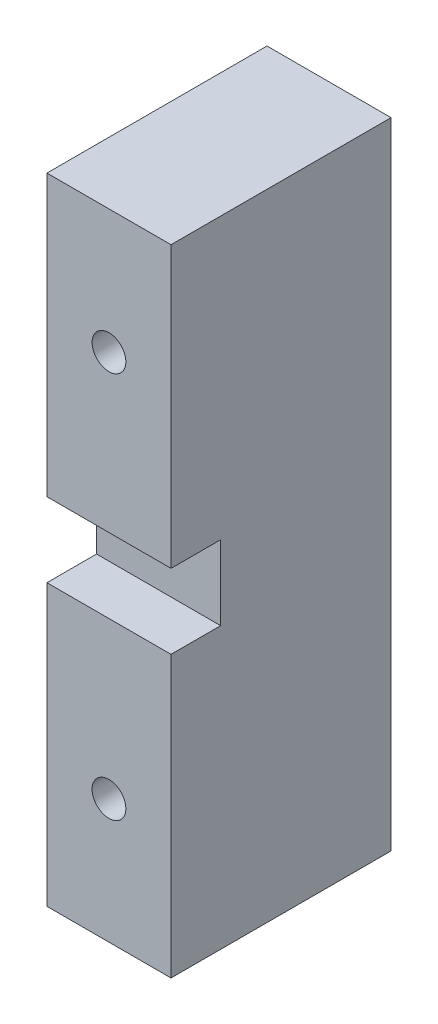
ISO-10303-21;
HEADER;
FILE_DESCRIPTION(('STEP AP214'),'2;1');
FILE_NAME('part.step','',(''),(''),'','','');
FILE_SCHEMA(('AUTOMOTIVE_DESIGN { 1 0 10303 214 1 1 1 1 }'));
ENDSEC;
DATA;
#1=APPLICATION_CONTEXT('core data for automotive mechanical design processes');
#2=APPLICATION_PROTOCOL_DEFINITION('international standard','automotive_design',2000,#1);
#3=PRODUCT_CONTEXT('',#1,'mechanical');
#4=PRODUCT('Part','Part','',(#3));
#5=PRODUCT_RELATED_PRODUCT_CATEGORY('part','',(#4));
#6=PRODUCT_DEFINITION_FORMATION('','',#4);
#7=PRODUCT_DEFINITION_CONTEXT('part definition',#1,'design');
#8=PRODUCT_DEFINITION('design','',#6,#7);
#9=PRODUCT_DEFINITION_SHAPE('','',#8);
#10=(LENGTH_UNIT() NAMED_UNIT(*) SI_UNIT(.MILLI.,.METRE.));
#11=(NAMED_UNIT(*) PLANE_ANGLE_UNIT() SI_UNIT($,.RADIAN.));
#12=(NAMED_UNIT(*) SI_UNIT($,.STERADIAN.) SOLID_ANGLE_UNIT());
#13=UNCERTAINTY_MEASURE_WITH_UNIT(LENGTH_MEASURE(1.E-05),#10,'distance_accuracy_value','');
#14=(GEOMETRIC_REPRESENTATION_CONTEXT(3) GLOBAL_UNCERTAINTY_ASSIGNED_CONTEXT((#13)) GLOBAL_UNIT_ASSIGNED_CONTEXT((#10,
#11,#12)) REPRESENTATION_CONTEXT('',''));
#15=CARTESIAN_POINT('',(0.,0.,0.));
#16=DIRECTION('',(0.,0.,1.));
#17=DIRECTION('',(1.,0.,0.));
#18=AXIS2_PLACEMENT_3D('',#15,#16,#17);
#19=CARTESIAN_POINT('',(0.,65.,22.5248));
#20=DIRECTION('',(0.,0.,1.));
#21=DIRECTION('',(1.,0.,0.));
#22=AXIS2_PLACEMENT_3D('',#19,#20,#21);
#23=PLANE('',#22);
#24=CARTESIAN_POINT('',(6.35,12.7,22.5248));
#25=DIRECTION('',(0.,0.,-1.));
#26=DIRECTION('',(-1.,0.,0.));
#27=AXIS2_PLACEMENT_3D('',#24,#25,#26);
#28=CIRCLE('',#27,1.72719999999998);
#29=CARTESIAN_POINT('',(4.62280000000002,12.7,22.5248));
#30=VERTEX_POINT('',#29);
#31=EDGE_CURVE('E183',#30,#30,#28,.T.);
#32=ORIENTED_EDGE('',*,*,#31,.T.);
#33=EDGE_LOOP('',(#32));
#34=FACE_BOUND('',#33,.T.);
#35=DIRECTION('',(-1.,0.,0.));
#36=VECTOR('',#35,1.);
#37=CARTESIAN_POINT('',(12.7,28.69,22.5248));
#38=LINE('',#37,#36);
#39=CARTESIAN_POINT('',(12.7,28.69,22.5248));
#40=VERTEX_POINT('',#39);
#41=CARTESIAN_POINT('',(0.,28.69,22.5248));
#42=VERTEX_POINT('',#41);
#43=EDGE_CURVE('E106',#40,#42,#38,.T.);
#44=ORIENTED_EDGE('',*,*,#43,.T.);
#45=DIRECTION('',(0.,-1.,0.));
#46=VECTOR('',#45,1.);
#47=CARTESIAN_POINT('',(0.,65.,22.5248));
#48=LINE('',#47,#46);
#49=CARTESIAN_POINT('',(0.,0.,22.5248));
#50=VERTEX_POINT('',#49);
#51=EDGE_CURVE('E146',#42,#50,#48,.T.);
#52=ORIENTED_EDGE('',*,*,#51,.T.);
#53=DIRECTION('',(1.,0.,0.));
#54=VECTOR('',#53,1.);
#55=CARTESIAN_POINT('',(0.,0.,22.5248));
#56=LINE('',#55,#54);
#57=CARTESIAN_POINT('',(12.7,0.,22.5248));
#58=VERTEX_POINT('',#57);
#59=EDGE_CURVE('E42',#50,#58,#56,.T.);
#60=ORIENTED_EDGE('',*,*,#59,.T.);
#61=DIRECTION('',(0.,-1.,0.));
#62=VECTOR('',#61,1.);
#63=CARTESIAN_POINT('',(12.7,65.,22.5248));
#64=LINE('',#63,#62);
#65=EDGE_CURVE('E120',#40,#58,#64,.T.);
#66=ORIENTED_EDGE('',*,*,#65,.F.);
#67=EDGE_LOOP('',(#44,#52,#60,#66));
#68=FACE_BOUND('',#67,.T.);
#69=ADVANCED_FACE('F33',(#34,#68),#23,.T.);
#70=CARTESIAN_POINT('',(0.,0.,0.));
#71=DIRECTION('',(0.,0.,-1.));
#72=DIRECTION('',(-1.,0.,0.));
#73=AXIS2_PLACEMENT_3D('',#70,#71,#72);
#74=PLANE('',#73);
#75=CARTESIAN_POINT('',(6.35,12.7,0.));
#76=DIRECTION('',(0.,0.,-1.));
#77=DIRECTION('',(-1.,0.,0.));
#78=AXIS2_PLACEMENT_3D('',#75,#76,#77);
#79=CIRCLE('',#78,1.72719999999999);
#80=CARTESIAN_POINT('',(4.62280000000001,12.7,0.));
#81=VERTEX_POINT('',#80);
#82=EDGE_CURVE('E177',#81,#81,#79,.T.);
#83=ORIENTED_EDGE('',*,*,#82,.F.);
#84=EDGE_LOOP('',(#83));
#85=FACE_BOUND('',#84,.T.);
#86=CARTESIAN_POINT('',(6.35,52.3,0.));
#87=DIRECTION('',(0.,0.,-1.));
#88=DIRECTION('',(-1.,0.,0.));
#89=AXIS2_PLACEMENT_3D('',#86,#87,#88);
#90=CIRCLE('',#89,1.72719999999999);
#91=CARTESIAN_POINT('',(4.62280000000001,52.3,0.));
#92=VERTEX_POINT('',#91);
#93=EDGE_CURVE('E180',#92,#92,#90,.T.);
#94=ORIENTED_EDGE('',*,*,#93,.F.);
#95=EDGE_LOOP('',(#94));
#96=FACE_BOUND('',#95,.T.);
#97=DIRECTION('',(0.,1.,0.));
#98=VECTOR('',#97,1.);
#99=CARTESIAN_POINT('',(12.7,0.,0.));
#100=LINE('',#99,#98);
#101=CARTESIAN_POINT('',(12.7,0.,0.));
#102=VERTEX_POINT('',#101);
#103=CARTESIAN_POINT('',(12.7,65.,0.));
#104=VERTEX_POINT('',#103);
#105=EDGE_CURVE('E133',#102,#104,#100,.T.);
#106=ORIENTED_EDGE('',*,*,#105,.F.);
#107=DIRECTION('',(1.,0.,0.));
#108=VECTOR('',#107,1.);
#109=CARTESIAN_POINT('',(0.,0.,0.));
#110=LINE('',#109,#108);
#111=CARTESIAN_POINT('',(0.,0.,0.));
#112=VERTEX_POINT('',#111);
#113=EDGE_CURVE('E11',#112,#102,#110,.T.);
#114=ORIENTED_EDGE('',*,*,#113,.F.);
#115=DIRECTION('',(0.,1.,0.));
#116=VECTOR('',#115,1.);
#117=CARTESIAN_POINT('',(0.,0.,0.));
#118=LINE('',#117,#116);
#119=CARTESIAN_POINT('',(0.,65.,0.));
#120=VERTEX_POINT('',#119);
#121=EDGE_CURVE('E137',#112,#120,#118,.T.);
#122=ORIENTED_EDGE('',*,*,#121,.T.);
#123=DIRECTION('',(1.,0.,0.));
#124=VECTOR('',#123,1.);
#125=CARTESIAN_POINT('',(0.,65.,0.));
#126=LINE('',#125,#124);
#127=EDGE_CURVE('E37',#120,#104,#126,.T.);
#128=ORIENTED_EDGE('',*,*,#127,.T.);
#129=EDGE_LOOP('',(#106,#114,#122,#128));
#130=FACE_BOUND('',#129,.T.);
#131=ADVANCED_FACE('F35',(#85,#96,#130),#74,.T.);
#132=CARTESIAN_POINT('',(0.,0.,22.5248));
#133=DIRECTION('',(0.,-1.,0.));
#134=DIRECTION('',(0.,0.,-1.));
#135=AXIS2_PLACEMENT_3D('',#132,#133,#134);
#136=PLANE('',#135);
#137=DIRECTION('',(0.,0.,-1.));
#138=VECTOR('',#137,1.);
#139=CARTESIAN_POINT('',(12.7,0.,22.5248));
#140=LINE('',#139,#138);
#141=EDGE_CURVE('E131',#58,#102,#140,.T.);
#142=ORIENTED_EDGE('',*,*,#141,.F.);
#143=ORIENTED_EDGE('',*,*,#59,.F.);
#144=DIRECTION('',(0.,0.,-1.));
#145=VECTOR('',#144,1.);
#146=CARTESIAN_POINT('',(0.,0.,22.5248));
#147=LINE('',#146,#145);
#148=EDGE_CURVE('E141',#50,#112,#147,.T.);
#149=ORIENTED_EDGE('',*,*,#148,.T.);
#150=ORIENTED_EDGE('',*,*,#113,.T.);
#151=EDGE_LOOP('',(#142,#143,#149,#150));
#152=FACE_BOUND('',#151,.T.);
#153=ADVANCED_FACE('F161',(#152),#136,.T.);
#154=CARTESIAN_POINT('',(6.35,52.3,22.5248));
#155=DIRECTION('',(0.,0.,-1.));
#156=DIRECTION('',(-1.,0.,0.));
#157=AXIS2_PLACEMENT_3D('',#154,#155,#156);
#158=CIRCLE('',#157,1.72719999999998);
#159=CARTESIAN_POINT('',(4.62280000000002,52.3,22.5248));
#160=VERTEX_POINT('',#159);
#161=EDGE_CURVE('E182',#160,#160,#158,.T.);
#162=ORIENTED_EDGE('',*,*,#161,.T.);
#163=EDGE_LOOP('',(#162));
#164=FACE_BOUND('',#163,.T.);
#165=DIRECTION('',(-1.,0.,0.));
#166=VECTOR('',#165,1.);
#167=CARTESIAN_POINT('',(12.7,36.31,22.5248));
#168=LINE('',#167,#166);
#169=CARTESIAN_POINT('',(12.7,36.31,22.5248));
#170=VERTEX_POINT('',#169);
#171=CARTESIAN_POINT('',(0.,36.31,22.5248));
#172=VERTEX_POINT('',#171);
#173=EDGE_CURVE('E115',#170,#172,#168,.T.);
#174=ORIENTED_EDGE('',*,*,#173,.F.);
#175=CARTESIAN_POINT('',(12.7,65.,22.5248));
#176=VERTEX_POINT('',#175);
#177=EDGE_CURVE('E127',#176,#170,#64,.T.);
#178=ORIENTED_EDGE('',*,*,#177,.F.);
#179=DIRECTION('',(1.,0.,0.));
#180=VECTOR('',#179,1.);
#181=CARTESIAN_POINT('',(0.,65.,22.5248));
#182=LINE('',#181,#180);
#183=CARTESIAN_POINT('',(0.,65.,22.5248));
#184=VERTEX_POINT('',#183);
#185=EDGE_CURVE('E139',#184,#176,#182,.T.);
#186=ORIENTED_EDGE('',*,*,#185,.F.);
#187=EDGE_CURVE('E142',#184,#172,#48,.T.);
#188=ORIENTED_EDGE('',*,*,#187,.T.);
#189=EDGE_LOOP('',(#174,#178,#186,#188));
#190=FACE_BOUND('',#189,.T.);
#191=ADVANCED_FACE('F170',(#164,#190),#23,.T.);
#192=CARTESIAN_POINT('',(0.,65.,0.));
#193=DIRECTION('',(0.,1.,0.));
#194=DIRECTION('',(0.,0.,1.));
#195=AXIS2_PLACEMENT_3D('',#192,#193,#194);
#196=PLANE('',#195);
#197=DIRECTION('',(0.,0.,1.));
#198=VECTOR('',#197,1.);
#199=CARTESIAN_POINT('',(12.7,65.,0.));
#200=LINE('',#199,#198);
#201=EDGE_CURVE('E128',#104,#176,#200,.T.);
#202=ORIENTED_EDGE('',*,*,#201,.F.);
#203=ORIENTED_EDGE('',*,*,#127,.F.);
#204=DIRECTION('',(0.,0.,1.));
#205=VECTOR('',#204,1.);
#206=CARTESIAN_POINT('',(0.,65.,0.));
#207=LINE('',#206,#205);
#208=EDGE_CURVE('E159',#120,#184,#207,.T.);
#209=ORIENTED_EDGE('',*,*,#208,.T.);
#210=ORIENTED_EDGE('',*,*,#185,.T.);
#211=EDGE_LOOP('',(#202,#203,#209,#210));
#212=FACE_BOUND('',#211,.T.);
#213=ADVANCED_FACE('F201',(#212),#196,.T.);
#214=CARTESIAN_POINT('',(0.,0.,0.));
#215=DIRECTION('',(1.,0.,0.));
#216=DIRECTION('',(0.,0.,-1.));
#217=AXIS2_PLACEMENT_3D('',#214,#215,#216);
#218=PLANE('',#217);
#219=ORIENTED_EDGE('',*,*,#51,.F.);
#220=DIRECTION('',(0.,0.,1.));
#221=VECTOR('',#220,1.);
#222=CARTESIAN_POINT('',(0.,28.69,17.4448));
#223=LINE('',#222,#221);
#224=CARTESIAN_POINT('',(0.,28.69,17.4448));
#225=VERTEX_POINT('',#224);
#226=EDGE_CURVE('E111',#225,#42,#223,.T.);
#227=ORIENTED_EDGE('',*,*,#226,.F.);
#228=DIRECTION('',(0.,-1.,0.));
#229=VECTOR('',#228,1.);
#230=CARTESIAN_POINT('',(0.,36.31,17.4448));
#231=LINE('',#230,#229);
#232=CARTESIAN_POINT('',(0.,36.31,17.4448));
#233=VERTEX_POINT('',#232);
#234=EDGE_CURVE('E124',#233,#225,#231,.T.);
#235=ORIENTED_EDGE('',*,*,#234,.F.);
#236=DIRECTION('',(0.,0.,-1.));
#237=VECTOR('',#236,1.);
#238=CARTESIAN_POINT('',(0.,36.31,22.5248));
#239=LINE('',#238,#237);
#240=EDGE_CURVE('E193',#172,#233,#239,.T.);
#241=ORIENTED_EDGE('',*,*,#240,.F.);
#242=ORIENTED_EDGE('',*,*,#187,.F.);
#243=ORIENTED_EDGE('',*,*,#208,.F.);
#244=ORIENTED_EDGE('',*,*,#121,.F.);
#245=ORIENTED_EDGE('',*,*,#148,.F.);
#246=EDGE_LOOP('',(#219,#227,#235,#241,#242,#243,#244,#245));
#247=FACE_BOUND('',#246,.T.);
#248=ADVANCED_FACE('F162',(#247),#218,.F.);
#249=CARTESIAN_POINT('',(12.7,0.,0.));
#250=DIRECTION('',(1.,0.,0.));
#251=DIRECTION('',(0.,0.,-1.));
#252=AXIS2_PLACEMENT_3D('',#249,#250,#251);
#253=PLANE('',#252);
#254=DIRECTION('',(0.,0.,1.));
#255=VECTOR('',#254,1.);
#256=CARTESIAN_POINT('',(12.7,28.69,17.4448));
#257=LINE('',#256,#255);
#258=CARTESIAN_POINT('',(12.7,28.69,17.4448));
#259=VERTEX_POINT('',#258);
#260=EDGE_CURVE('E109',#259,#40,#257,.T.);
#261=ORIENTED_EDGE('',*,*,#260,.T.);
#262=ORIENTED_EDGE('',*,*,#65,.T.);
#263=ORIENTED_EDGE('',*,*,#141,.T.);
#264=ORIENTED_EDGE('',*,*,#105,.T.);
#265=ORIENTED_EDGE('',*,*,#201,.T.);
#266=ORIENTED_EDGE('',*,*,#177,.T.);
#267=DIRECTION('',(0.,0.,-1.));
#268=VECTOR('',#267,1.);
#269=CARTESIAN_POINT('',(12.7,36.31,22.5248));
#270=LINE('',#269,#268);
#271=CARTESIAN_POINT('',(12.7,36.31,17.4448));
#272=VERTEX_POINT('',#271);
#273=EDGE_CURVE('E123',#170,#272,#270,.T.);
#274=ORIENTED_EDGE('',*,*,#273,.T.);
#275=DIRECTION('',(0.,-1.,0.));
#276=VECTOR('',#275,1.);
#277=CARTESIAN_POINT('',(12.7,36.31,17.4448));
#278=LINE('',#277,#276);
#279=EDGE_CURVE('E50',#272,#259,#278,.T.);
#280=ORIENTED_EDGE('',*,*,#279,.T.);
#281=EDGE_LOOP('',(#261,#262,#263,#264,#265,#266,#274,#280));
#282=FACE_BOUND('',#281,.T.);
#283=ADVANCED_FACE('F118',(#282),#253,.T.);
#284=CARTESIAN_POINT('',(12.7,28.69,17.4448));
#285=DIRECTION('',(0.,-1.,0.));
#286=DIRECTION('',(0.,0.,-1.));
#287=AXIS2_PLACEMENT_3D('',#284,#285,#286);
#288=PLANE('',#287);
#289=ORIENTED_EDGE('',*,*,#226,.T.);
#290=ORIENTED_EDGE('',*,*,#43,.F.);
#291=ORIENTED_EDGE('',*,*,#260,.F.);
#292=DIRECTION('',(-1.,0.,0.));
#293=VECTOR('',#292,1.);
#294=CARTESIAN_POINT('',(12.7,28.69,17.4448));
#295=LINE('',#294,#293);
#296=EDGE_CURVE('E150',#259,#225,#295,.T.);
#297=ORIENTED_EDGE('',*,*,#296,.T.);
#298=EDGE_LOOP('',(#289,#290,#291,#297));
#299=FACE_BOUND('',#298,.T.);
#300=ADVANCED_FACE('F108',(#299),#288,.F.);
#301=CARTESIAN_POINT('',(12.7,36.31,17.4448));
#302=DIRECTION('',(0.,0.,-1.));
#303=DIRECTION('',(-1.,0.,0.));
#304=AXIS2_PLACEMENT_3D('',#301,#302,#303);
#305=PLANE('',#304);
#306=ORIENTED_EDGE('',*,*,#234,.T.);
#307=ORIENTED_EDGE('',*,*,#296,.F.);
#308=ORIENTED_EDGE('',*,*,#279,.F.);
#309=DIRECTION('',(-1.,0.,0.));
#310=VECTOR('',#309,1.);
#311=CARTESIAN_POINT('',(12.7,36.31,17.4448));
#312=LINE('',#311,#310);
#313=EDGE_CURVE('E151',#272,#233,#312,.T.);
#314=ORIENTED_EDGE('',*,*,#313,.T.);
#315=EDGE_LOOP('',(#306,#307,#308,#314));
#316=FACE_BOUND('',#315,.T.);
#317=ADVANCED_FACE('F198',(#316),#305,.F.);
#318=CARTESIAN_POINT('',(12.7,36.31,22.5248));
#319=DIRECTION('',(0.,1.,0.));
#320=DIRECTION('',(0.,0.,1.));
#321=AXIS2_PLACEMENT_3D('',#318,#319,#320);
#322=PLANE('',#321);
#323=ORIENTED_EDGE('',*,*,#240,.T.);
#324=ORIENTED_EDGE('',*,*,#313,.F.);
#325=ORIENTED_EDGE('',*,*,#273,.F.);
#326=ORIENTED_EDGE('',*,*,#173,.T.);
#327=EDGE_LOOP('',(#323,#324,#325,#326));
#328=FACE_BOUND('',#327,.T.);
#329=ADVANCED_FACE('F214',(#328),#322,.F.);
#330=CARTESIAN_POINT('',(6.35,52.3,0.));
#331=DIRECTION('',(0.,0.,-1.));
#332=DIRECTION('',(-1.,0.,0.));
#333=AXIS2_PLACEMENT_3D('',#330,#331,#332);
#334=CYLINDRICAL_SURFACE('',#333,1.72719999999999);
#335=ORIENTED_EDGE('',*,*,#161,.F.);
#336=EDGE_LOOP('',(#335));
#337=FACE_BOUND('',#336,.T.);
#338=ORIENTED_EDGE('',*,*,#93,.T.);
#339=EDGE_LOOP('',(#338));
#340=FACE_BOUND('',#339,.T.);
#341=ADVANCED_FACE('F217',(#337,#340),#334,.F.);
#342=CARTESIAN_POINT('',(6.35,12.7,0.));
#343=DIRECTION('',(0.,0.,-1.));
#344=DIRECTION('',(-1.,0.,0.));
#345=AXIS2_PLACEMENT_3D('',#342,#343,#344);
#346=CYLINDRICAL_SURFACE('',#345,1.72719999999999);
#347=ORIENTED_EDGE('',*,*,#31,.F.);
#348=EDGE_LOOP('',(#347));
#349=FACE_BOUND('',#348,.T.);
#350=ORIENTED_EDGE('',*,*,#82,.T.);
#351=EDGE_LOOP('',(#350));
#352=FACE_BOUND('',#351,.T.);
#353=ADVANCED_FACE('F222',(#349,#352),#346,.F.);
#354=CLOSED_SHELL('',(#69,#131,#153,#191,#213,#248,#283,#300,#317,#329,#341,#353));
#355=MANIFOLD_SOLID_BREP('B2',#354);
#356=ADVANCED_BREP_SHAPE_REPRESENTATION('',(#18,#355),#14);
#357=SHAPE_DEFINITION_REPRESENTATION(#9,#356);
ENDSEC;
END-ISO-10303-21;
